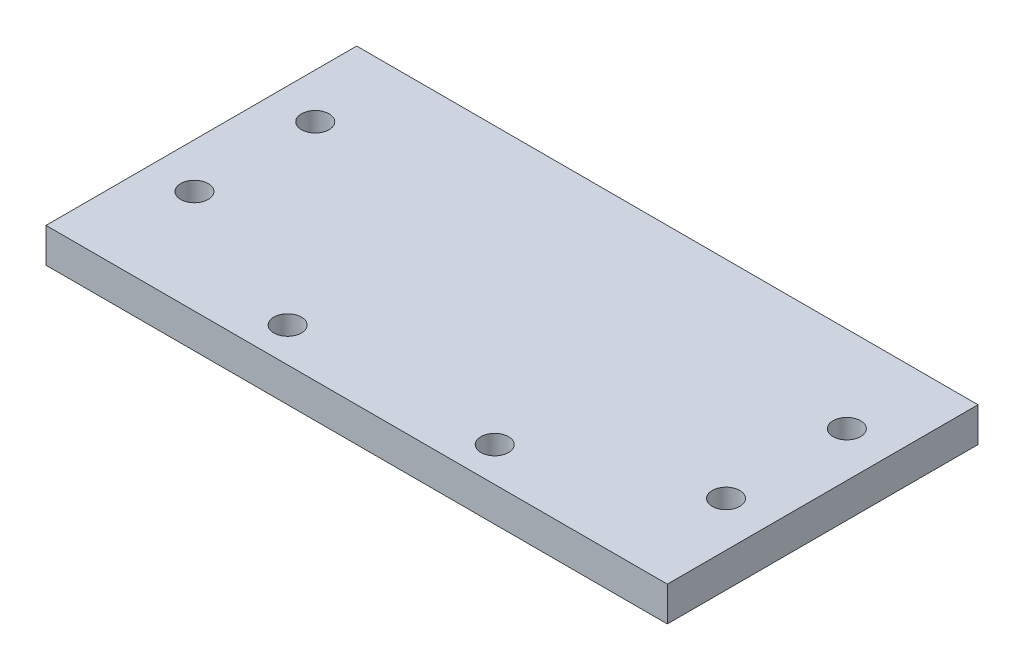
ISO-10303-21;
HEADER;
FILE_DESCRIPTION(('STEP AP214'),'2;1');
FILE_NAME('part.step','',(''),(''),'','','');
FILE_SCHEMA(('AUTOMOTIVE_DESIGN { 1 0 10303 214 1 1 1 1 }'));
ENDSEC;
DATA;
#1=APPLICATION_CONTEXT('core data for automotive mechanical design processes');
#2=APPLICATION_PROTOCOL_DEFINITION('international standard','automotive_design',2000,#1);
#3=PRODUCT_CONTEXT('',#1,'mechanical');
#4=PRODUCT('Part','Part','',(#3));
#5=PRODUCT_RELATED_PRODUCT_CATEGORY('part','',(#4));
#6=PRODUCT_DEFINITION_FORMATION('','',#4);
#7=PRODUCT_DEFINITION_CONTEXT('part definition',#1,'design');
#8=PRODUCT_DEFINITION('design','',#6,#7);
#9=PRODUCT_DEFINITION_SHAPE('','',#8);
#10=(LENGTH_UNIT() NAMED_UNIT(*) SI_UNIT(.MILLI.,.METRE.));
#11=(NAMED_UNIT(*) PLANE_ANGLE_UNIT() SI_UNIT($,.RADIAN.));
#12=(NAMED_UNIT(*) SI_UNIT($,.STERADIAN.) SOLID_ANGLE_UNIT());
#13=UNCERTAINTY_MEASURE_WITH_UNIT(LENGTH_MEASURE(1.E-05),#10,'distance_accuracy_value','');
#14=(GEOMETRIC_REPRESENTATION_CONTEXT(3) GLOBAL_UNCERTAINTY_ASSIGNED_CONTEXT((#13)) GLOBAL_UNIT_ASSIGNED_CONTEXT((#10,
#11,#12)) REPRESENTATION_CONTEXT('',''));
#15=CARTESIAN_POINT('',(0.,0.,0.));
#16=DIRECTION('',(0.,0.,1.));
#17=DIRECTION('',(1.,0.,0.));
#18=AXIS2_PLACEMENT_3D('',#15,#16,#17);
#19=CARTESIAN_POINT('',(0.,10.,0.));
#20=DIRECTION('',(0.,-1.,0.));
#21=DIRECTION('',(0.,0.,-1.));
#22=AXIS2_PLACEMENT_3D('',#19,#20,#21);
#23=PLANE('',#22);
#24=DIRECTION('',(0.,0.,-1.));
#25=VECTOR('',#24,1.);
#26=CARTESIAN_POINT('',(90.,10.,45.));
#27=LINE('',#26,#25);
#28=CARTESIAN_POINT('',(90.,10.,45.));
#29=VERTEX_POINT('',#28);
#30=CARTESIAN_POINT('',(90.,10.,-45.));
#31=VERTEX_POINT('',#30);
#32=EDGE_CURVE('E92',#29,#31,#27,.T.);
#33=ORIENTED_EDGE('',*,*,#32,.T.);
#34=DIRECTION('',(-1.,0.,0.));
#35=VECTOR('',#34,1.);
#36=CARTESIAN_POINT('',(-90.,10.,-45.));
#37=LINE('',#36,#35);
#38=CARTESIAN_POINT('',(-90.,10.,-45.));
#39=VERTEX_POINT('',#38);
#40=EDGE_CURVE('E87',#31,#39,#37,.T.);
#41=ORIENTED_EDGE('',*,*,#40,.T.);
#42=DIRECTION('',(0.,0.,1.));
#43=VECTOR('',#42,1.);
#44=CARTESIAN_POINT('',(-90.,10.,45.));
#45=LINE('',#44,#43);
#46=CARTESIAN_POINT('',(-90.,10.,45.));
#47=VERTEX_POINT('',#46);
#48=EDGE_CURVE('E90',#39,#47,#45,.T.);
#49=ORIENTED_EDGE('',*,*,#48,.T.);
#50=DIRECTION('',(1.,0.,0.));
#51=VECTOR('',#50,1.);
#52=CARTESIAN_POINT('',(-90.,10.,45.));
#53=LINE('',#52,#51);
#54=EDGE_CURVE('E57',#47,#29,#53,.T.);
#55=ORIENTED_EDGE('',*,*,#54,.T.);
#56=EDGE_LOOP('',(#33,#41,#49,#55));
#57=FACE_BOUND('',#56,.T.);
#58=CARTESIAN_POINT('',(-77.,10.,-20.));
#59=DIRECTION('',(0.,1.,0.));
#60=DIRECTION('',(0.,0.,1.));
#61=AXIS2_PLACEMENT_3D('',#58,#59,#60);
#62=CIRCLE('',#61,4.00000000000001);
#63=CARTESIAN_POINT('',(-77.,10.,-16.));
#64=VERTEX_POINT('',#63);
#65=EDGE_CURVE('E107',#64,#64,#62,.T.);
#66=ORIENTED_EDGE('',*,*,#65,.F.);
#67=EDGE_LOOP('',(#66));
#68=FACE_BOUND('',#67,.T.);
#69=CARTESIAN_POINT('',(-77.,10.,15.));
#70=DIRECTION('',(0.,1.,0.));
#71=DIRECTION('',(0.,0.,-1.));
#72=AXIS2_PLACEMENT_3D('',#69,#70,#71);
#73=CIRCLE('',#72,4.00000000000001);
#74=CARTESIAN_POINT('',(-77.,10.,11.));
#75=VERTEX_POINT('',#74);
#76=EDGE_CURVE('E122',#75,#75,#73,.T.);
#77=ORIENTED_EDGE('',*,*,#76,.F.);
#78=EDGE_LOOP('',(#77));
#79=FACE_BOUND('',#78,.T.);
#80=CARTESIAN_POINT('',(-30.,10.,35.));
#81=DIRECTION('',(0.,1.,0.));
#82=DIRECTION('',(0.,0.,1.));
#83=AXIS2_PLACEMENT_3D('',#80,#81,#82);
#84=CIRCLE('',#83,4.);
#85=CARTESIAN_POINT('',(-30.,10.,39.));
#86=VERTEX_POINT('',#85);
#87=EDGE_CURVE('E128',#86,#86,#84,.T.);
#88=ORIENTED_EDGE('',*,*,#87,.F.);
#89=EDGE_LOOP('',(#88));
#90=FACE_BOUND('',#89,.T.);
#91=CARTESIAN_POINT('',(77.,10.,-20.));
#92=DIRECTION('',(0.,1.,0.));
#93=DIRECTION('',(0.,0.,-1.));
#94=AXIS2_PLACEMENT_3D('',#91,#92,#93);
#95=CIRCLE('',#94,4.00000000000001);
#96=CARTESIAN_POINT('',(77.,10.,-24.));
#97=VERTEX_POINT('',#96);
#98=EDGE_CURVE('E134',#97,#97,#95,.T.);
#99=ORIENTED_EDGE('',*,*,#98,.F.);
#100=EDGE_LOOP('',(#99));
#101=FACE_BOUND('',#100,.T.);
#102=CARTESIAN_POINT('',(77.,10.,15.));
#103=DIRECTION('',(0.,1.,0.));
#104=DIRECTION('',(0.,0.,1.));
#105=AXIS2_PLACEMENT_3D('',#102,#103,#104);
#106=CIRCLE('',#105,4.00000000000001);
#107=CARTESIAN_POINT('',(77.,10.,19.));
#108=VERTEX_POINT('',#107);
#109=EDGE_CURVE('E140',#108,#108,#106,.T.);
#110=ORIENTED_EDGE('',*,*,#109,.F.);
#111=EDGE_LOOP('',(#110));
#112=FACE_BOUND('',#111,.T.);
#113=CARTESIAN_POINT('',(30.,10.,35.));
#114=DIRECTION('',(0.,1.,0.));
#115=DIRECTION('',(0.,0.,-1.));
#116=AXIS2_PLACEMENT_3D('',#113,#114,#115);
#117=CIRCLE('',#116,4.00000000000001);
#118=CARTESIAN_POINT('',(30.,10.,31.));
#119=VERTEX_POINT('',#118);
#120=EDGE_CURVE('E146',#119,#119,#117,.T.);
#121=ORIENTED_EDGE('',*,*,#120,.F.);
#122=EDGE_LOOP('',(#121));
#123=FACE_BOUND('',#122,.T.);
#124=ADVANCED_FACE('F40',(#57,#68,#79,#90,#101,#112,#123),#23,.F.);
#125=CARTESIAN_POINT('',(0.,0.,0.));
#126=DIRECTION('',(0.,-1.,0.));
#127=DIRECTION('',(0.,0.,-1.));
#128=AXIS2_PLACEMENT_3D('',#125,#126,#127);
#129=PLANE('',#128);
#130=CARTESIAN_POINT('',(77.,0.,15.));
#131=DIRECTION('',(0.,1.,0.));
#132=DIRECTION('',(0.,0.,1.));
#133=AXIS2_PLACEMENT_3D('',#130,#131,#132);
#134=CIRCLE('',#133,4.00000000000001);
#135=CARTESIAN_POINT('',(77.,0.,19.));
#136=VERTEX_POINT('',#135);
#137=EDGE_CURVE('E143',#136,#136,#134,.T.);
#138=ORIENTED_EDGE('',*,*,#137,.T.);
#139=EDGE_LOOP('',(#138));
#140=FACE_BOUND('',#139,.T.);
#141=CARTESIAN_POINT('',(-30.,0.,35.));
#142=DIRECTION('',(0.,1.,0.));
#143=DIRECTION('',(0.,0.,1.));
#144=AXIS2_PLACEMENT_3D('',#141,#142,#143);
#145=CIRCLE('',#144,4.);
#146=CARTESIAN_POINT('',(-30.,0.,39.));
#147=VERTEX_POINT('',#146);
#148=EDGE_CURVE('E131',#147,#147,#145,.T.);
#149=ORIENTED_EDGE('',*,*,#148,.T.);
#150=EDGE_LOOP('',(#149));
#151=FACE_BOUND('',#150,.T.);
#152=CARTESIAN_POINT('',(-77.,0.,-20.));
#153=DIRECTION('',(0.,1.,0.));
#154=DIRECTION('',(0.,0.,1.));
#155=AXIS2_PLACEMENT_3D('',#152,#153,#154);
#156=CIRCLE('',#155,4.00000000000001);
#157=CARTESIAN_POINT('',(-77.,0.,-16.));
#158=VERTEX_POINT('',#157);
#159=EDGE_CURVE('E119',#158,#158,#156,.T.);
#160=ORIENTED_EDGE('',*,*,#159,.T.);
#161=EDGE_LOOP('',(#160));
#162=FACE_BOUND('',#161,.T.);
#163=DIRECTION('',(0.,0.,-1.));
#164=VECTOR('',#163,1.);
#165=CARTESIAN_POINT('',(90.,0.,45.));
#166=LINE('',#165,#164);
#167=CARTESIAN_POINT('',(90.,0.,45.));
#168=VERTEX_POINT('',#167);
#169=CARTESIAN_POINT('',(90.,0.,-45.));
#170=VERTEX_POINT('',#169);
#171=EDGE_CURVE('E104',#168,#170,#166,.T.);
#172=ORIENTED_EDGE('',*,*,#171,.F.);
#173=DIRECTION('',(1.,0.,0.));
#174=VECTOR('',#173,1.);
#175=CARTESIAN_POINT('',(-90.,0.,45.));
#176=LINE('',#175,#174);
#177=CARTESIAN_POINT('',(-90.,0.,45.));
#178=VERTEX_POINT('',#177);
#179=EDGE_CURVE('E80',#178,#168,#176,.T.);
#180=ORIENTED_EDGE('',*,*,#179,.F.);
#181=DIRECTION('',(0.,0.,1.));
#182=VECTOR('',#181,1.);
#183=CARTESIAN_POINT('',(-90.,0.,45.));
#184=LINE('',#183,#182);
#185=CARTESIAN_POINT('',(-90.,0.,-45.));
#186=VERTEX_POINT('',#185);
#187=EDGE_CURVE('E74',#186,#178,#184,.T.);
#188=ORIENTED_EDGE('',*,*,#187,.F.);
#189=DIRECTION('',(-1.,0.,0.));
#190=VECTOR('',#189,1.);
#191=CARTESIAN_POINT('',(-90.,0.,-45.));
#192=LINE('',#191,#190);
#193=EDGE_CURVE('E96',#170,#186,#192,.T.);
#194=ORIENTED_EDGE('',*,*,#193,.F.);
#195=EDGE_LOOP('',(#172,#180,#188,#194));
#196=FACE_BOUND('',#195,.T.);
#197=CARTESIAN_POINT('',(-77.,0.,15.));
#198=DIRECTION('',(0.,1.,0.));
#199=DIRECTION('',(0.,0.,-1.));
#200=AXIS2_PLACEMENT_3D('',#197,#198,#199);
#201=CIRCLE('',#200,4.00000000000001);
#202=CARTESIAN_POINT('',(-77.,0.,11.));
#203=VERTEX_POINT('',#202);
#204=EDGE_CURVE('E125',#203,#203,#201,.T.);
#205=ORIENTED_EDGE('',*,*,#204,.T.);
#206=EDGE_LOOP('',(#205));
#207=FACE_BOUND('',#206,.T.);
#208=CARTESIAN_POINT('',(77.,0.,-20.));
#209=DIRECTION('',(0.,1.,0.));
#210=DIRECTION('',(0.,0.,-1.));
#211=AXIS2_PLACEMENT_3D('',#208,#209,#210);
#212=CIRCLE('',#211,4.00000000000001);
#213=CARTESIAN_POINT('',(77.,0.,-24.));
#214=VERTEX_POINT('',#213);
#215=EDGE_CURVE('E137',#214,#214,#212,.T.);
#216=ORIENTED_EDGE('',*,*,#215,.T.);
#217=EDGE_LOOP('',(#216));
#218=FACE_BOUND('',#217,.T.);
#219=CARTESIAN_POINT('',(30.,0.,35.));
#220=DIRECTION('',(0.,1.,0.));
#221=DIRECTION('',(0.,0.,-1.));
#222=AXIS2_PLACEMENT_3D('',#219,#220,#221);
#223=CIRCLE('',#222,4.00000000000001);
#224=CARTESIAN_POINT('',(30.,0.,31.));
#225=VERTEX_POINT('',#224);
#226=EDGE_CURVE('E149',#225,#225,#223,.T.);
#227=ORIENTED_EDGE('',*,*,#226,.T.);
#228=EDGE_LOOP('',(#227));
#229=FACE_BOUND('',#228,.T.);
#230=ADVANCED_FACE('F115',(#140,#151,#162,#196,#207,#218,#229),#129,.T.);
#231=CARTESIAN_POINT('',(90.,10.,45.));
#232=DIRECTION('',(-1.,0.,0.));
#233=DIRECTION('',(0.,0.,1.));
#234=AXIS2_PLACEMENT_3D('',#231,#232,#233);
#235=PLANE('',#234);
#236=ORIENTED_EDGE('',*,*,#171,.T.);
#237=DIRECTION('',(0.,-1.,0.));
#238=VECTOR('',#237,1.);
#239=CARTESIAN_POINT('',(90.,10.,-45.));
#240=LINE('',#239,#238);
#241=EDGE_CURVE('E11',#31,#170,#240,.T.);
#242=ORIENTED_EDGE('',*,*,#241,.F.);
#243=ORIENTED_EDGE('',*,*,#32,.F.);
#244=DIRECTION('',(0.,-1.,0.));
#245=VECTOR('',#244,1.);
#246=CARTESIAN_POINT('',(90.,10.,45.));
#247=LINE('',#246,#245);
#248=EDGE_CURVE('E100',#29,#168,#247,.T.);
#249=ORIENTED_EDGE('',*,*,#248,.T.);
#250=EDGE_LOOP('',(#236,#242,#243,#249));
#251=FACE_BOUND('',#250,.T.);
#252=ADVANCED_FACE('F42',(#251),#235,.F.);
#253=CARTESIAN_POINT('',(-90.,10.,-45.));
#254=DIRECTION('',(0.,0.,1.));
#255=DIRECTION('',(1.,0.,0.));
#256=AXIS2_PLACEMENT_3D('',#253,#254,#255);
#257=PLANE('',#256);
#258=ORIENTED_EDGE('',*,*,#193,.T.);
#259=DIRECTION('',(0.,-1.,0.));
#260=VECTOR('',#259,1.);
#261=CARTESIAN_POINT('',(-90.,10.,-45.));
#262=LINE('',#261,#260);
#263=EDGE_CURVE('E49',#39,#186,#262,.T.);
#264=ORIENTED_EDGE('',*,*,#263,.F.);
#265=ORIENTED_EDGE('',*,*,#40,.F.);
#266=ORIENTED_EDGE('',*,*,#241,.T.);
#267=EDGE_LOOP('',(#258,#264,#265,#266));
#268=FACE_BOUND('',#267,.T.);
#269=ADVANCED_FACE('F95',(#268),#257,.F.);
#270=CARTESIAN_POINT('',(-90.,10.,45.));
#271=DIRECTION('',(1.,0.,0.));
#272=DIRECTION('',(0.,0.,-1.));
#273=AXIS2_PLACEMENT_3D('',#270,#271,#272);
#274=PLANE('',#273);
#275=ORIENTED_EDGE('',*,*,#187,.T.);
#276=DIRECTION('',(0.,-1.,0.));
#277=VECTOR('',#276,1.);
#278=CARTESIAN_POINT('',(-90.,10.,45.));
#279=LINE('',#278,#277);
#280=EDGE_CURVE('E97',#47,#178,#279,.T.);
#281=ORIENTED_EDGE('',*,*,#280,.F.);
#282=ORIENTED_EDGE('',*,*,#48,.F.);
#283=ORIENTED_EDGE('',*,*,#263,.T.);
#284=EDGE_LOOP('',(#275,#281,#282,#283));
#285=FACE_BOUND('',#284,.T.);
#286=ADVANCED_FACE('F98',(#285),#274,.F.);
#287=CARTESIAN_POINT('',(-90.,10.,45.));
#288=DIRECTION('',(0.,0.,-1.));
#289=DIRECTION('',(-1.,0.,0.));
#290=AXIS2_PLACEMENT_3D('',#287,#288,#289);
#291=PLANE('',#290);
#292=ORIENTED_EDGE('',*,*,#179,.T.);
#293=ORIENTED_EDGE('',*,*,#248,.F.);
#294=ORIENTED_EDGE('',*,*,#54,.F.);
#295=ORIENTED_EDGE('',*,*,#280,.T.);
#296=EDGE_LOOP('',(#292,#293,#294,#295));
#297=FACE_BOUND('',#296,.T.);
#298=ADVANCED_FACE('F112',(#297),#291,.F.);
#299=CARTESIAN_POINT('',(-77.,10.,-20.));
#300=DIRECTION('',(0.,-1.,0.));
#301=DIRECTION('',(0.,0.,-1.));
#302=AXIS2_PLACEMENT_3D('',#299,#300,#301);
#303=CYLINDRICAL_SURFACE('',#302,4.00000000000001);
#304=ORIENTED_EDGE('',*,*,#65,.T.);
#305=EDGE_LOOP('',(#304));
#306=FACE_BOUND('',#305,.T.);
#307=ORIENTED_EDGE('',*,*,#159,.F.);
#308=EDGE_LOOP('',(#307));
#309=FACE_BOUND('',#308,.T.);
#310=ADVANCED_FACE('F166',(#306,#309),#303,.F.);
#311=CARTESIAN_POINT('',(-77.,10.,15.));
#312=DIRECTION('',(0.,-1.,0.));
#313=DIRECTION('',(0.,0.,-1.));
#314=AXIS2_PLACEMENT_3D('',#311,#312,#313);
#315=CYLINDRICAL_SURFACE('',#314,4.00000000000001);
#316=ORIENTED_EDGE('',*,*,#76,.T.);
#317=EDGE_LOOP('',(#316));
#318=FACE_BOUND('',#317,.T.);
#319=ORIENTED_EDGE('',*,*,#204,.F.);
#320=EDGE_LOOP('',(#319));
#321=FACE_BOUND('',#320,.T.);
#322=ADVANCED_FACE('F220',(#318,#321),#315,.F.);
#323=CARTESIAN_POINT('',(-30.,10.,35.));
#324=DIRECTION('',(0.,-1.,0.));
#325=DIRECTION('',(0.,0.,-1.));
#326=AXIS2_PLACEMENT_3D('',#323,#324,#325);
#327=CYLINDRICAL_SURFACE('',#326,4.);
#328=ORIENTED_EDGE('',*,*,#87,.T.);
#329=EDGE_LOOP('',(#328));
#330=FACE_BOUND('',#329,.T.);
#331=ORIENTED_EDGE('',*,*,#148,.F.);
#332=EDGE_LOOP('',(#331));
#333=FACE_BOUND('',#332,.T.);
#334=ADVANCED_FACE('F229',(#330,#333),#327,.F.);
#335=CARTESIAN_POINT('',(77.,10.,-20.));
#336=DIRECTION('',(0.,-1.,0.));
#337=DIRECTION('',(0.,0.,-1.));
#338=AXIS2_PLACEMENT_3D('',#335,#336,#337);
#339=CYLINDRICAL_SURFACE('',#338,4.00000000000001);
#340=ORIENTED_EDGE('',*,*,#98,.T.);
#341=EDGE_LOOP('',(#340));
#342=FACE_BOUND('',#341,.T.);
#343=ORIENTED_EDGE('',*,*,#215,.F.);
#344=EDGE_LOOP('',(#343));
#345=FACE_BOUND('',#344,.T.);
#346=ADVANCED_FACE('F238',(#342,#345),#339,.F.);
#347=CARTESIAN_POINT('',(77.,10.,15.));
#348=DIRECTION('',(0.,-1.,0.));
#349=DIRECTION('',(0.,0.,-1.));
#350=AXIS2_PLACEMENT_3D('',#347,#348,#349);
#351=CYLINDRICAL_SURFACE('',#350,4.00000000000001);
#352=ORIENTED_EDGE('',*,*,#109,.T.);
#353=EDGE_LOOP('',(#352));
#354=FACE_BOUND('',#353,.T.);
#355=ORIENTED_EDGE('',*,*,#137,.F.);
#356=EDGE_LOOP('',(#355));
#357=FACE_BOUND('',#356,.T.);
#358=ADVANCED_FACE('F248',(#354,#357),#351,.F.);
#359=CARTESIAN_POINT('',(30.,10.,35.));
#360=DIRECTION('',(0.,-1.,0.));
#361=DIRECTION('',(0.,0.,-1.));
#362=AXIS2_PLACEMENT_3D('',#359,#360,#361);
#363=CYLINDRICAL_SURFACE('',#362,4.00000000000001);
#364=ORIENTED_EDGE('',*,*,#120,.T.);
#365=EDGE_LOOP('',(#364));
#366=FACE_BOUND('',#365,.T.);
#367=ORIENTED_EDGE('',*,*,#226,.F.);
#368=EDGE_LOOP('',(#367));
#369=FACE_BOUND('',#368,.T.);
#370=ADVANCED_FACE('F155',(#366,#369),#363,.F.);
#371=CLOSED_SHELL('',(#124,#230,#252,#269,#286,#298,#310,#322,#334,#346,#358,#370));
#372=MANIFOLD_SOLID_BREP('B2',#371);
#373=ADVANCED_BREP_SHAPE_REPRESENTATION('',(#18,#372),#14);
#374=SHAPE_DEFINITION_REPRESENTATION(#9,#373);
ENDSEC;
END-ISO-10303-21;
